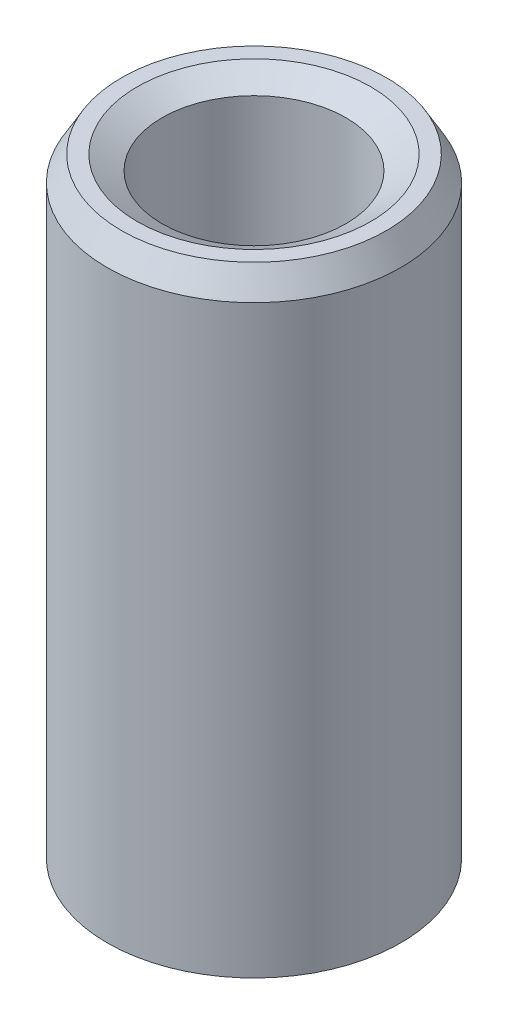
ISO-10303-21;
HEADER;
FILE_DESCRIPTION(('STEP AP214'),'2;1');
FILE_NAME('part.step','',(''),(''),'','','');
FILE_SCHEMA(('AUTOMOTIVE_DESIGN { 1 0 10303 214 1 1 1 1 }'));
ENDSEC;
DATA;
#1=APPLICATION_CONTEXT('core data for automotive mechanical design processes');
#2=APPLICATION_PROTOCOL_DEFINITION('international standard','automotive_design',2000,#1);
#3=PRODUCT_CONTEXT('',#1,'mechanical');
#4=PRODUCT('Part','Part','',(#3));
#5=PRODUCT_RELATED_PRODUCT_CATEGORY('part','',(#4));
#6=PRODUCT_DEFINITION_FORMATION('','',#4);
#7=PRODUCT_DEFINITION_CONTEXT('part definition',#1,'design');
#8=PRODUCT_DEFINITION('design','',#6,#7);
#9=PRODUCT_DEFINITION_SHAPE('','',#8);
#10=(LENGTH_UNIT() NAMED_UNIT(*) SI_UNIT(.MILLI.,.METRE.));
#11=(NAMED_UNIT(*) PLANE_ANGLE_UNIT() SI_UNIT($,.RADIAN.));
#12=(NAMED_UNIT(*) SI_UNIT($,.STERADIAN.) SOLID_ANGLE_UNIT());
#13=UNCERTAINTY_MEASURE_WITH_UNIT(LENGTH_MEASURE(1.E-05),#10,'distance_accuracy_value','');
#14=(GEOMETRIC_REPRESENTATION_CONTEXT(3) GLOBAL_UNCERTAINTY_ASSIGNED_CONTEXT((#13)) GLOBAL_UNIT_ASSIGNED_CONTEXT((#10,
#11,#12)) REPRESENTATION_CONTEXT('',''));
#15=CARTESIAN_POINT('',(0.,0.,0.));
#16=DIRECTION('',(0.,0.,1.));
#17=DIRECTION('',(1.,0.,0.));
#18=AXIS2_PLACEMENT_3D('',#15,#16,#17);
#19=CARTESIAN_POINT('',(0.,74.3815949704727,0.));
#20=DIRECTION('',(0.,-1.,0.));
#21=DIRECTION('',(0.,0.,-1.));
#22=AXIS2_PLACEMENT_3D('',#19,#20,#21);
#23=CYLINDRICAL_SURFACE('',#22,17.5);
#24=CARTESIAN_POINT('',(0.,1.71039972237265,0.));
#25=DIRECTION('',(0.,1.,0.));
#26=DIRECTION('',(0.,0.,1.));
#27=AXIS2_PLACEMENT_3D('',#24,#25,#26);
#28=CIRCLE('',#27,17.5);
#29=CARTESIAN_POINT('',(0.,1.71039972237265,17.5));
#30=VERTEX_POINT('',#29);
#31=EDGE_CURVE('E10',#30,#30,#28,.T.);
#32=ORIENTED_EDGE('',*,*,#31,.T.);
#33=EDGE_LOOP('',(#32));
#34=FACE_BOUND('',#33,.T.);
#35=CARTESIAN_POINT('',(0.,71.4190957500716,0.));
#36=DIRECTION('',(0.,1.,0.));
#37=DIRECTION('',(0.,0.,1.));
#38=AXIS2_PLACEMENT_3D('',#35,#36,#37);
#39=CIRCLE('',#38,17.5);
#40=CARTESIAN_POINT('',(0.,71.4190957500716,17.5));
#41=VERTEX_POINT('',#40);
#42=EDGE_CURVE('E50',#41,#41,#39,.F.);
#43=ORIENTED_EDGE('',*,*,#42,.T.);
#44=EDGE_LOOP('',(#43));
#45=FACE_BOUND('',#44,.T.);
#46=ADVANCED_FACE('F39',(#34,#45),#23,.T.);
#47=CARTESIAN_POINT('',(0.,74.3815949704727,0.));
#48=DIRECTION('',(0.,1.,0.));
#49=DIRECTION('',(0.,0.,1.));
#50=AXIS2_PLACEMENT_3D('',#47,#48,#49);
#51=PLANE('',#50);
#52=CARTESIAN_POINT('',(0.,74.3815949704727,0.));
#53=DIRECTION('',(0.,1.,0.));
#54=DIRECTION('',(0.,0.,1.));
#55=AXIS2_PLACEMENT_3D('',#52,#53,#54);
#56=CIRCLE('',#55,13.9204015381213);
#57=CARTESIAN_POINT('',(0.,74.3815949704727,13.9204015381213));
#58=VERTEX_POINT('',#57);
#59=EDGE_CURVE('E58',#58,#58,#56,.F.);
#60=ORIENTED_EDGE('',*,*,#59,.T.);
#61=EDGE_LOOP('',(#60));
#62=FACE_BOUND('',#61,.T.);
#63=CARTESIAN_POINT('',(0.,74.3815949704727,0.));
#64=DIRECTION('',(0.,1.,0.));
#65=DIRECTION('',(0.,0.,1.));
#66=AXIS2_PLACEMENT_3D('',#63,#64,#65);
#67=CIRCLE('',#66,15.7896002776274);
#68=CARTESIAN_POINT('',(0.,74.3815949704727,15.7896002776274));
#69=VERTEX_POINT('',#68);
#70=EDGE_CURVE('E61',#69,#69,#67,.T.);
#71=ORIENTED_EDGE('',*,*,#70,.T.);
#72=EDGE_LOOP('',(#71));
#73=FACE_BOUND('',#72,.T.);
#74=ADVANCED_FACE('F88',(#62,#73),#51,.T.);
#75=CARTESIAN_POINT('',(0.,0.,0.));
#76=DIRECTION('',(0.,1.,0.));
#77=DIRECTION('',(0.,0.,1.));
#78=AXIS2_PLACEMENT_3D('',#75,#76,#77);
#79=PLANE('',#78);
#80=CARTESIAN_POINT('',(0.,0.,0.));
#81=DIRECTION('',(0.,1.,0.));
#82=DIRECTION('',(0.,0.,1.));
#83=AXIS2_PLACEMENT_3D('',#80,#81,#82);
#84=CIRCLE('',#83,12.6683020400928);
#85=CARTESIAN_POINT('',(0.,0.,-12.6683020400928));
#86=VERTEX_POINT('',#85);
#87=EDGE_CURVE('E51',#86,#86,#84,.T.);
#88=ORIENTED_EDGE('',*,*,#87,.T.);
#89=EDGE_LOOP('',(#88));
#90=FACE_BOUND('',#89,.T.);
#91=CARTESIAN_POINT('',(0.,0.,0.));
#92=DIRECTION('',(0.,1.,0.));
#93=DIRECTION('',(0.,0.,1.));
#94=AXIS2_PLACEMENT_3D('',#91,#92,#93);
#95=CIRCLE('',#94,14.5375007795988);
#96=CARTESIAN_POINT('',(0.,0.,14.5375007795988));
#97=VERTEX_POINT('',#96);
#98=EDGE_CURVE('E54',#97,#97,#95,.F.);
#99=ORIENTED_EDGE('',*,*,#98,.T.);
#100=EDGE_LOOP('',(#99));
#101=FACE_BOUND('',#100,.T.);
#102=ADVANCED_FACE('F83',(#90,#101),#79,.F.);
#103=CARTESIAN_POINT('',(0.,74.3815949704727,0.));
#104=DIRECTION('',(0.,-1.,0.));
#105=DIRECTION('',(0.,0.,-1.));
#106=AXIS2_PLACEMENT_3D('',#103,#104,#105);
#107=CYLINDRICAL_SURFACE('',#106,10.9579023177201);
#108=CARTESIAN_POINT('',(0.,72.6711952481001,0.));
#109=DIRECTION('',(0.,1.,0.));
#110=DIRECTION('',(0.,0.,1.));
#111=AXIS2_PLACEMENT_3D('',#108,#109,#110);
#112=CIRCLE('',#111,10.9579023177201);
#113=CARTESIAN_POINT('',(0.,72.6711952481001,10.9579023177201));
#114=VERTEX_POINT('',#113);
#115=EDGE_CURVE('E67',#114,#114,#112,.T.);
#116=ORIENTED_EDGE('',*,*,#115,.T.);
#117=EDGE_LOOP('',(#116));
#118=FACE_BOUND('',#117,.T.);
#119=CARTESIAN_POINT('',(0.,2.96249922040116,0.));
#120=DIRECTION('',(0.,1.,0.));
#121=DIRECTION('',(0.,0.,1.));
#122=AXIS2_PLACEMENT_3D('',#119,#120,#121);
#123=CIRCLE('',#122,10.9579023177201);
#124=CARTESIAN_POINT('',(0.,2.96249922040116,-10.9579023177201));
#125=VERTEX_POINT('',#124);
#126=EDGE_CURVE('E69',#125,#125,#123,.F.);
#127=ORIENTED_EDGE('',*,*,#126,.T.);
#128=EDGE_LOOP('',(#127));
#129=FACE_BOUND('',#128,.T.);
#130=ADVANCED_FACE('F71',(#118,#129),#107,.F.);
#131=CARTESIAN_POINT('',(0.,72.6711952481001,0.));
#132=DIRECTION('',(0.,1.,0.));
#133=DIRECTION('',(0.,0.,1.));
#134=AXIS2_PLACEMENT_3D('',#131,#132,#133);
#135=CONICAL_SURFACE('',#134,10.9579023177201,1.0471975511966);
#136=ORIENTED_EDGE('',*,*,#59,.F.);
#137=EDGE_LOOP('',(#136));
#138=FACE_BOUND('',#137,.T.);
#139=ORIENTED_EDGE('',*,*,#115,.F.);
#140=EDGE_LOOP('',(#139));
#141=FACE_BOUND('',#140,.T.);
#142=ADVANCED_FACE('F77',(#138,#141),#135,.F.);
#143=CARTESIAN_POINT('',(0.,0.,0.));
#144=DIRECTION('',(0.,-1.,0.));
#145=DIRECTION('',(0.,0.,-1.));
#146=AXIS2_PLACEMENT_3D('',#143,#144,#145);
#147=CONICAL_SURFACE('',#146,12.6683020400928,0.523598775598294);
#148=CARTESIAN_POINT('',(0.,2.96249922040116,-10.9579023177201));
#149=CARTESIAN_POINT('',(0.,2.93163985352198,-10.9757189814949));
#150=CARTESIAN_POINT('',(0.,2.9007804866428,-10.9935356452696));
#151=CARTESIAN_POINT('',(0.,2.83906175288445,-11.029168972819));
#152=CARTESIAN_POINT('',(0.,2.80820238600527,-11.0469856365937));
#153=CARTESIAN_POINT('',(0.,2.74648365224691,-11.0826189641431));
#154=CARTESIAN_POINT('',(0.,2.71562428536773,-11.1004356279179));
#155=CARTESIAN_POINT('',(0.,2.65390555160937,-11.1360689554673));
#156=CARTESIAN_POINT('',(0.,2.6230461847302,-11.153885619242));
#157=CARTESIAN_POINT('',(0.,2.56132745097184,-11.1895189467914));
#158=CARTESIAN_POINT('',(0.,2.53046808409266,-11.2073356105661));
#159=CARTESIAN_POINT('',(0.,2.4687493503343,-11.2429689381156));
#160=CARTESIAN_POINT('',(0.,2.43788998345512,-11.2607856018903));
#161=CARTESIAN_POINT('',(0.,2.37617124969677,-11.2964189294397));
#162=CARTESIAN_POINT('',(0.,2.34531188281759,-11.3142355932144));
#163=CARTESIAN_POINT('',(0.,2.28359314905923,-11.3498689207639));
#164=CARTESIAN_POINT('',(0.,2.25273378218005,-11.3676855845386));
#165=CARTESIAN_POINT('',(0.,2.19101504842169,-11.403318912088));
#166=CARTESIAN_POINT('',(0.,2.16015568154251,-11.4211355758627));
#167=CARTESIAN_POINT('',(0.,2.09843694778416,-11.4567689034122));
#168=CARTESIAN_POINT('',(0.,2.06757758090498,-11.4745855671869));
#169=CARTESIAN_POINT('',(0.,2.00585884714662,-11.5102188947363));
#170=CARTESIAN_POINT('',(0.,1.97499948026744,-11.528035558511));
#171=CARTESIAN_POINT('',(0.,1.91328074650908,-11.5636688860604));
#172=CARTESIAN_POINT('',(0.,1.88242137962991,-11.5814855498352));
#173=CARTESIAN_POINT('',(0.,1.82070264587155,-11.6171188773846));
#174=CARTESIAN_POINT('',(0.,1.78984327899237,-11.6349355411593));
#175=CARTESIAN_POINT('',(0.,1.72812454523401,-11.6705688687087));
#176=CARTESIAN_POINT('',(0.,1.69726517835483,-11.6883855324835));
#177=CARTESIAN_POINT('',(0.,1.63554644459648,-11.7240188600329));
#178=CARTESIAN_POINT('',(0.,1.6046870777173,-11.7418355238076));
#179=CARTESIAN_POINT('',(0.,1.54296834395894,-11.777468851357));
#180=CARTESIAN_POINT('',(0.,1.51210897707976,-11.7952855151317));
#181=CARTESIAN_POINT('',(0.,1.4503902433214,-11.8309188426812));
#182=CARTESIAN_POINT('',(0.,1.41953087644222,-11.8487355064559));
#183=CARTESIAN_POINT('',(0.,1.35781214268387,-11.8843688340053));
#184=CARTESIAN_POINT('',(0.,1.32695277580469,-11.90218549778));
#185=CARTESIAN_POINT('',(0.,1.26523404204633,-11.9378188253295));
#186=CARTESIAN_POINT('',(0.,1.23437467516715,-11.9556354891042));
#187=CARTESIAN_POINT('',(0.,1.17265594140879,-11.9912688166536));
#188=CARTESIAN_POINT('',(0.,1.14179657452961,-12.0090854804283));
#189=CARTESIAN_POINT('',(0.,1.08007784077126,-12.0447188079778));
#190=CARTESIAN_POINT('',(0.,1.04921847389208,-12.0625354717525));
#191=CARTESIAN_POINT('',(0.,0.987499740133721,-12.0981687993019));
#192=CARTESIAN_POINT('',(0.,0.956640373254542,-12.1159854630766));
#193=CARTESIAN_POINT('',(0.,0.894921639496185,-12.151618790626));
#194=CARTESIAN_POINT('',(0.,0.864062272617006,-12.1694354544008));
#195=CARTESIAN_POINT('',(0.,0.802343538858648,-12.2050687819502));
#196=CARTESIAN_POINT('',(0.,0.771484171979469,-12.2228854457249));
#197=CARTESIAN_POINT('',(0.,0.709765438221112,-12.2585187732743));
#198=CARTESIAN_POINT('',(0.,0.678906071341933,-12.2763354370491));
#199=CARTESIAN_POINT('',(0.,0.617187337583575,-12.3119687645985));
#200=CARTESIAN_POINT('',(0.,0.586327970704397,-12.3297854283732));
#201=CARTESIAN_POINT('',(0.,0.524609236946039,-12.3654187559226));
#202=CARTESIAN_POINT('',(0.,0.49374987006686,-12.3832354196973));
#203=CARTESIAN_POINT('',(0.,0.432031136308503,-12.4188687472468));
#204=CARTESIAN_POINT('',(0.,0.401171769429324,-12.4366854110215));
#205=CARTESIAN_POINT('',(0.,0.339453035670966,-12.4723187385709));
#206=CARTESIAN_POINT('',(0.,0.308593668791788,-12.4901354023456));
#207=CARTESIAN_POINT('',(0.,0.24687493503343,-12.5257687298951));
#208=CARTESIAN_POINT('',(0.,0.216015568154251,-12.5435853936698));
#209=CARTESIAN_POINT('',(0.,0.154296834395894,-12.5792187212192));
#210=CARTESIAN_POINT('',(0.,0.123437467516715,-12.5970353849939));
#211=CARTESIAN_POINT('',(0.,0.0617187337583575,-12.6326687125434));
#212=CARTESIAN_POINT('',(0.,0.0308593668791786,-12.6504853763181));
#213=CARTESIAN_POINT('',(0.,0.,-12.6683020400928));
#214=B_SPLINE_CURVE_WITH_KNOTS('',3,(#148,#149,#150,#151,#152,#153,#154,#155,#156,#157,#158,
#159,#160,#161,#162,#163,#164,#165,#166,#167,#168,#169,#170,#171,#172,#173,#174,#175,#176,#177,
#178,#179,#180,#181,#182,#183,#184,#185,#186,#187,#188,#189,#190,#191,#192,#193,#194,#195,#196,
#197,#198,#199,#200,#201,#202,#203,#204,#205,#206,#207,#208,#209,#210,#211,#212,#213),
.UNSPECIFIED.,.F.,.F.,(4,2,2,2,2,2,2,2,2,2,2,2,2,2,2,2,2,2,2,2,2,2,2,2,2,2,2,2,2,2,2,2,4),(0.,
0.106899982648291,0.213799965296582,0.320699947944875,0.427599930593166,0.534499913241457,
0.641399895889749,0.74829987853804,0.855199861186332,0.962099843834623,1.06899982648291,
1.17589980913121,1.2827997917795,1.38969977442779,1.49659975707608,1.60349973972437,
1.71039972237266,1.81729970502095,1.92419968766925,2.03109967031754,2.13799965296583,
2.24489963561412,2.35179961826241,2.4586996009107,2.565599583559,2.67249956620729,
2.77939954885558,2.88629953150387,2.99319951415216,3.10009949680045,3.20699947944874,
3.31389946209704,3.42079944474533),.UNSPECIFIED.);
#215=EDGE_CURVE('BSEAM73',#125,#86,#214,.T.);
#216=ORIENTED_EDGE('',*,*,#126,.F.);
#217=ORIENTED_EDGE('',*,*,#87,.F.);
#218=ORIENTED_EDGE('',*,*,#215,.T.);
#219=ORIENTED_EDGE('',*,*,#215,.F.);
#220=EDGE_LOOP('',(#216,#218,#217,#219));
#221=FACE_BOUND('',#220,.T.);
#222=ADVANCED_FACE('F73',(#221),#147,.F.);
#223=CARTESIAN_POINT('',(0.,1.71039972237265,0.));
#224=DIRECTION('',(0.,1.,0.));
#225=DIRECTION('',(0.,0.,1.));
#226=AXIS2_PLACEMENT_3D('',#223,#224,#225);
#227=CONICAL_SURFACE('',#226,17.5,1.0471975511966);
#228=ORIENTED_EDGE('',*,*,#98,.F.);
#229=EDGE_LOOP('',(#228));
#230=FACE_BOUND('',#229,.T.);
#231=ORIENTED_EDGE('',*,*,#31,.F.);
#232=EDGE_LOOP('',(#231));
#233=FACE_BOUND('',#232,.T.);
#234=ADVANCED_FACE('F76',(#230,#233),#227,.T.);
#235=CARTESIAN_POINT('',(0.,74.3815949704727,0.));
#236=DIRECTION('',(0.,-1.,0.));
#237=DIRECTION('',(0.,0.,-1.));
#238=AXIS2_PLACEMENT_3D('',#235,#236,#237);
#239=CONICAL_SURFACE('',#238,15.7896002776274,0.523598775598295);
#240=ORIENTED_EDGE('',*,*,#42,.F.);
#241=EDGE_LOOP('',(#240));
#242=FACE_BOUND('',#241,.T.);
#243=ORIENTED_EDGE('',*,*,#70,.F.);
#244=EDGE_LOOP('',(#243));
#245=FACE_BOUND('',#244,.T.);
#246=ADVANCED_FACE('F45',(#242,#245),#239,.T.);
#247=CLOSED_SHELL('',(#46,#74,#102,#130,#142,#222,#234,#246));
#248=MANIFOLD_SOLID_BREP('B2',#247);
#249=ADVANCED_BREP_SHAPE_REPRESENTATION('',(#18,#248),#14);
#250=SHAPE_DEFINITION_REPRESENTATION(#9,#249);
ENDSEC;
END-ISO-10303-21;
